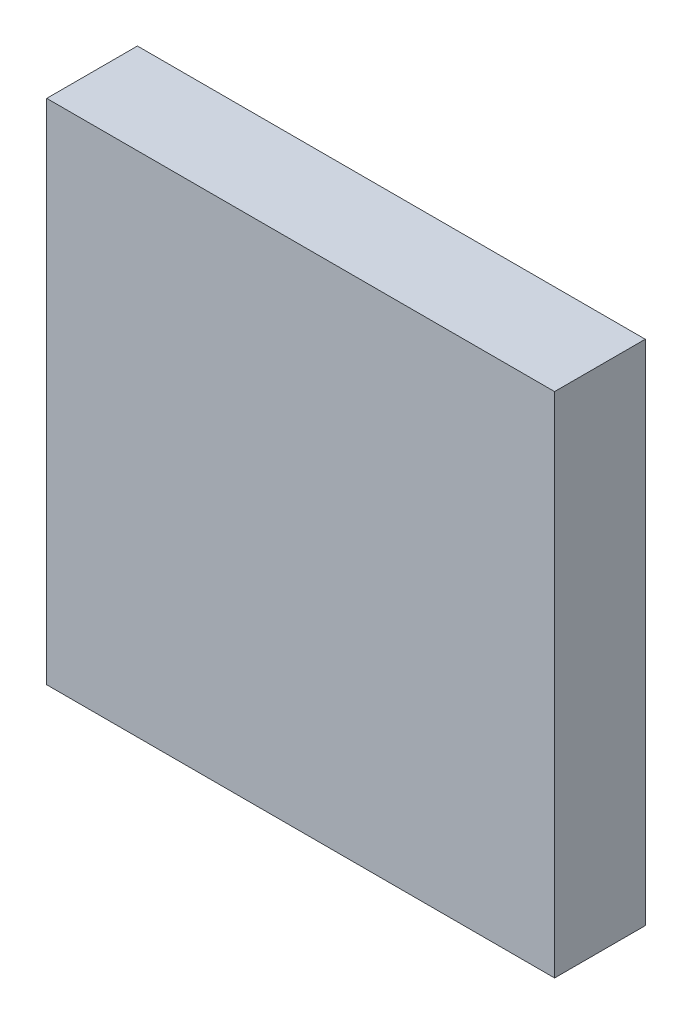
ISO-10303-21;
HEADER;
FILE_DESCRIPTION(('STEP AP214'),'2;1');
FILE_NAME('part.step','',(''),(''),'','','');
FILE_SCHEMA(('AUTOMOTIVE_DESIGN { 1 0 10303 214 1 1 1 1 }'));
ENDSEC;
DATA;
#1=APPLICATION_CONTEXT('core data for automotive mechanical design processes');
#2=APPLICATION_PROTOCOL_DEFINITION('international standard','automotive_design',2000,#1);
#3=PRODUCT_CONTEXT('',#1,'mechanical');
#4=PRODUCT('Part','Part','',(#3));
#5=PRODUCT_RELATED_PRODUCT_CATEGORY('part','',(#4));
#6=PRODUCT_DEFINITION_FORMATION('','',#4);
#7=PRODUCT_DEFINITION_CONTEXT('part definition',#1,'design');
#8=PRODUCT_DEFINITION('design','',#6,#7);
#9=PRODUCT_DEFINITION_SHAPE('','',#8);
#10=(LENGTH_UNIT() NAMED_UNIT(*) SI_UNIT(.MILLI.,.METRE.));
#11=(NAMED_UNIT(*) PLANE_ANGLE_UNIT() SI_UNIT($,.RADIAN.));
#12=(NAMED_UNIT(*) SI_UNIT($,.STERADIAN.) SOLID_ANGLE_UNIT());
#13=UNCERTAINTY_MEASURE_WITH_UNIT(LENGTH_MEASURE(1.E-05),#10,'distance_accuracy_value','');
#14=(GEOMETRIC_REPRESENTATION_CONTEXT(3) GLOBAL_UNCERTAINTY_ASSIGNED_CONTEXT((#13)) GLOBAL_UNIT_ASSIGNED_CONTEXT((#10,
#11,#12)) REPRESENTATION_CONTEXT('',''));
#15=CARTESIAN_POINT('',(0.,0.,0.));
#16=DIRECTION('',(0.,0.,1.));
#17=DIRECTION('',(1.,0.,0.));
#18=AXIS2_PLACEMENT_3D('',#15,#16,#17);
#19=CARTESIAN_POINT('',(3.5,-3.5,1.25));
#20=DIRECTION('',(-1.,0.,0.));
#21=DIRECTION('',(0.,0.,1.));
#22=AXIS2_PLACEMENT_3D('',#19,#20,#21);
#23=PLANE('',#22);
#24=DIRECTION('',(0.,1.,0.));
#25=VECTOR('',#24,1.);
#26=CARTESIAN_POINT('',(3.5,-3.5,0.));
#27=LINE('',#26,#25);
#28=CARTESIAN_POINT('',(3.5,-3.5,0.));
#29=VERTEX_POINT('',#28);
#30=CARTESIAN_POINT('',(3.5,3.5,0.));
#31=VERTEX_POINT('',#30);
#32=EDGE_CURVE('E107',#29,#31,#27,.T.);
#33=ORIENTED_EDGE('',*,*,#32,.T.);
#34=DIRECTION('',(0.,0.,-1.));
#35=VECTOR('',#34,1.);
#36=CARTESIAN_POINT('',(3.5,3.5,1.25));
#37=LINE('',#36,#35);
#38=CARTESIAN_POINT('',(3.5,3.5,1.25));
#39=VERTEX_POINT('',#38);
#40=EDGE_CURVE('E11',#39,#31,#37,.T.);
#41=ORIENTED_EDGE('',*,*,#40,.F.);
#42=DIRECTION('',(0.,1.,0.));
#43=VECTOR('',#42,1.);
#44=CARTESIAN_POINT('',(3.5,-3.5,1.25));
#45=LINE('',#44,#43);
#46=CARTESIAN_POINT('',(3.5,-3.5,1.25));
#47=VERTEX_POINT('',#46);
#48=EDGE_CURVE('E91',#47,#39,#45,.T.);
#49=ORIENTED_EDGE('',*,*,#48,.F.);
#50=DIRECTION('',(0.,0.,-1.));
#51=VECTOR('',#50,1.);
#52=CARTESIAN_POINT('',(3.5,-3.5,1.25));
#53=LINE('',#52,#51);
#54=EDGE_CURVE('E103',#47,#29,#53,.T.);
#55=ORIENTED_EDGE('',*,*,#54,.T.);
#56=EDGE_LOOP('',(#33,#41,#49,#55));
#57=FACE_BOUND('',#56,.T.);
#58=ADVANCED_FACE('F39',(#57),#23,.F.);
#59=CARTESIAN_POINT('',(-3.5,3.5,1.25));
#60=DIRECTION('',(0.,-1.,0.));
#61=DIRECTION('',(0.,0.,-1.));
#62=AXIS2_PLACEMENT_3D('',#59,#60,#61);
#63=PLANE('',#62);
#64=DIRECTION('',(-1.,0.,0.));
#65=VECTOR('',#64,1.);
#66=CARTESIAN_POINT('',(-3.5,3.5,0.));
#67=LINE('',#66,#65);
#68=CARTESIAN_POINT('',(-3.5,3.5,0.));
#69=VERTEX_POINT('',#68);
#70=EDGE_CURVE('E96',#31,#69,#67,.T.);
#71=ORIENTED_EDGE('',*,*,#70,.T.);
#72=DIRECTION('',(0.,0.,-1.));
#73=VECTOR('',#72,1.);
#74=CARTESIAN_POINT('',(-3.5,3.5,1.25));
#75=LINE('',#74,#73);
#76=CARTESIAN_POINT('',(-3.5,3.5,1.25));
#77=VERTEX_POINT('',#76);
#78=EDGE_CURVE('E48',#77,#69,#75,.T.);
#79=ORIENTED_EDGE('',*,*,#78,.F.);
#80=DIRECTION('',(-1.,0.,0.));
#81=VECTOR('',#80,1.);
#82=CARTESIAN_POINT('',(-3.5,3.5,1.25));
#83=LINE('',#82,#81);
#84=EDGE_CURVE('E86',#39,#77,#83,.T.);
#85=ORIENTED_EDGE('',*,*,#84,.F.);
#86=ORIENTED_EDGE('',*,*,#40,.T.);
#87=EDGE_LOOP('',(#71,#79,#85,#86));
#88=FACE_BOUND('',#87,.T.);
#89=ADVANCED_FACE('F95',(#88),#63,.F.);
#90=CARTESIAN_POINT('',(-3.5,-3.5,1.25));
#91=DIRECTION('',(1.,0.,0.));
#92=DIRECTION('',(0.,0.,-1.));
#93=AXIS2_PLACEMENT_3D('',#90,#91,#92);
#94=PLANE('',#93);
#95=DIRECTION('',(0.,-1.,0.));
#96=VECTOR('',#95,1.);
#97=CARTESIAN_POINT('',(-3.5,-3.5,0.));
#98=LINE('',#97,#96);
#99=CARTESIAN_POINT('',(-3.5,-3.5,0.));
#100=VERTEX_POINT('',#99);
#101=EDGE_CURVE('E73',#69,#100,#98,.T.);
#102=ORIENTED_EDGE('',*,*,#101,.T.);
#103=DIRECTION('',(0.,0.,-1.));
#104=VECTOR('',#103,1.);
#105=CARTESIAN_POINT('',(-3.5,-3.5,1.25));
#106=LINE('',#105,#104);
#107=CARTESIAN_POINT('',(-3.5,-3.5,1.25));
#108=VERTEX_POINT('',#107);
#109=EDGE_CURVE('E98',#108,#100,#106,.T.);
#110=ORIENTED_EDGE('',*,*,#109,.F.);
#111=DIRECTION('',(0.,-1.,0.));
#112=VECTOR('',#111,1.);
#113=CARTESIAN_POINT('',(-3.5,-3.5,1.25));
#114=LINE('',#113,#112);
#115=EDGE_CURVE('E89',#77,#108,#114,.T.);
#116=ORIENTED_EDGE('',*,*,#115,.F.);
#117=ORIENTED_EDGE('',*,*,#78,.T.);
#118=EDGE_LOOP('',(#102,#110,#116,#117));
#119=FACE_BOUND('',#118,.T.);
#120=ADVANCED_FACE('F99',(#119),#94,.F.);
#121=CARTESIAN_POINT('',(-3.5,-3.5,1.25));
#122=DIRECTION('',(0.,1.,0.));
#123=DIRECTION('',(0.,0.,1.));
#124=AXIS2_PLACEMENT_3D('',#121,#122,#123);
#125=PLANE('',#124);
#126=DIRECTION('',(1.,0.,0.));
#127=VECTOR('',#126,1.);
#128=CARTESIAN_POINT('',(-3.5,-3.5,0.));
#129=LINE('',#128,#127);
#130=EDGE_CURVE('E79',#100,#29,#129,.T.);
#131=ORIENTED_EDGE('',*,*,#130,.T.);
#132=ORIENTED_EDGE('',*,*,#54,.F.);
#133=DIRECTION('',(1.,0.,0.));
#134=VECTOR('',#133,1.);
#135=CARTESIAN_POINT('',(-3.5,-3.5,1.25));
#136=LINE('',#135,#134);
#137=EDGE_CURVE('E56',#108,#47,#136,.T.);
#138=ORIENTED_EDGE('',*,*,#137,.F.);
#139=ORIENTED_EDGE('',*,*,#109,.T.);
#140=EDGE_LOOP('',(#131,#132,#138,#139));
#141=FACE_BOUND('',#140,.T.);
#142=ADVANCED_FACE('F120',(#141),#125,.F.);
#143=CARTESIAN_POINT('',(0.,0.,1.25));
#144=DIRECTION('',(0.,0.,-1.));
#145=DIRECTION('',(-1.,0.,0.));
#146=AXIS2_PLACEMENT_3D('',#143,#144,#145);
#147=PLANE('',#146);
#148=ORIENTED_EDGE('',*,*,#48,.T.);
#149=ORIENTED_EDGE('',*,*,#84,.T.);
#150=ORIENTED_EDGE('',*,*,#115,.T.);
#151=ORIENTED_EDGE('',*,*,#137,.T.);
#152=EDGE_LOOP('',(#148,#149,#150,#151));
#153=FACE_BOUND('',#152,.T.);
#154=ADVANCED_FACE('F87',(#153),#147,.F.);
#155=CARTESIAN_POINT('',(0.,0.,0.));
#156=DIRECTION('',(0.,0.,-1.));
#157=DIRECTION('',(-1.,0.,0.));
#158=AXIS2_PLACEMENT_3D('',#155,#156,#157);
#159=PLANE('',#158);
#160=ORIENTED_EDGE('',*,*,#32,.F.);
#161=ORIENTED_EDGE('',*,*,#130,.F.);
#162=ORIENTED_EDGE('',*,*,#101,.F.);
#163=ORIENTED_EDGE('',*,*,#70,.F.);
#164=EDGE_LOOP('',(#160,#161,#162,#163));
#165=FACE_BOUND('',#164,.T.);
#166=ADVANCED_FACE('F123',(#165),#159,.T.);
#167=CLOSED_SHELL('',(#58,#89,#120,#142,#154,#166));
#168=MANIFOLD_SOLID_BREP('B2',#167);
#169=ADVANCED_BREP_SHAPE_REPRESENTATION('',(#18,#168),#14);
#170=SHAPE_DEFINITION_REPRESENTATION(#9,#169);
ENDSEC;
END-ISO-10303-21;
